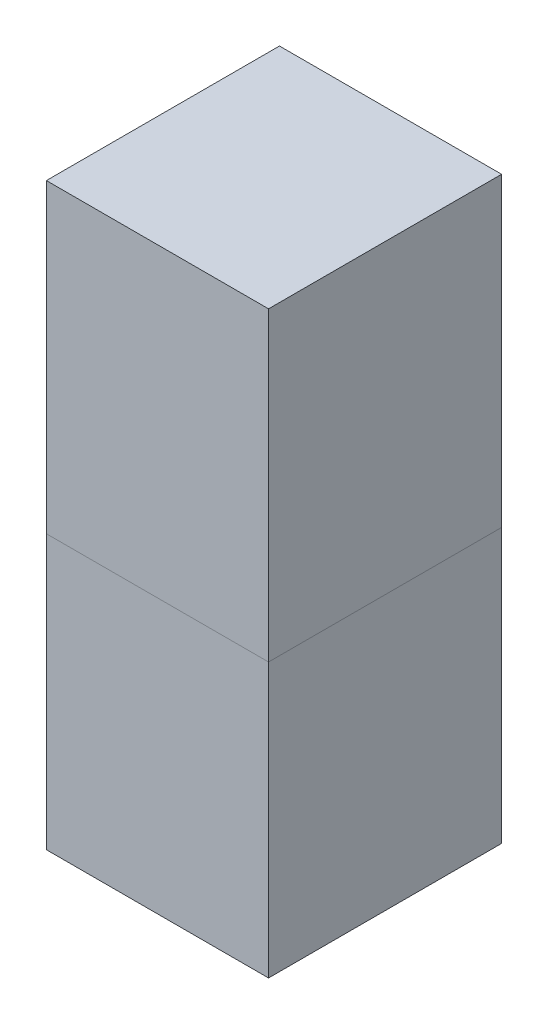
ISO-10303-21;
HEADER;
FILE_DESCRIPTION(('STEP AP214'),'2;1');
FILE_NAME('part.step','',(''),(''),'','','');
FILE_SCHEMA(('AUTOMOTIVE_DESIGN { 1 0 10303 214 1 1 1 1 }'));
ENDSEC;
DATA;
#1=APPLICATION_CONTEXT('core data for automotive mechanical design processes');
#2=APPLICATION_PROTOCOL_DEFINITION('international standard','automotive_design',2000,#1);
#3=PRODUCT_CONTEXT('',#1,'mechanical');
#4=PRODUCT('Part','Part','',(#3));
#5=PRODUCT_RELATED_PRODUCT_CATEGORY('part','',(#4));
#6=PRODUCT_DEFINITION_FORMATION('','',#4);
#7=PRODUCT_DEFINITION_CONTEXT('part definition',#1,'design');
#8=PRODUCT_DEFINITION('design','',#6,#7);
#9=PRODUCT_DEFINITION_SHAPE('','',#8);
#10=(LENGTH_UNIT() NAMED_UNIT(*) SI_UNIT(.MILLI.,.METRE.));
#11=(NAMED_UNIT(*) PLANE_ANGLE_UNIT() SI_UNIT($,.RADIAN.));
#12=(NAMED_UNIT(*) SI_UNIT($,.STERADIAN.) SOLID_ANGLE_UNIT());
#13=UNCERTAINTY_MEASURE_WITH_UNIT(LENGTH_MEASURE(1.E-05),#10,'distance_accuracy_value','');
#14=(GEOMETRIC_REPRESENTATION_CONTEXT(3) GLOBAL_UNCERTAINTY_ASSIGNED_CONTEXT((#13)) GLOBAL_UNIT_ASSIGNED_CONTEXT((#10,
#11,#12)) REPRESENTATION_CONTEXT('',''));
#15=CARTESIAN_POINT('',(0.,0.,0.));
#16=DIRECTION('',(0.,0.,1.));
#17=DIRECTION('',(1.,0.,0.));
#18=AXIS2_PLACEMENT_3D('',#15,#16,#17);
#19=CARTESIAN_POINT('',(0.,-1700.,0.));
#20=DIRECTION('',(0.,1.,0.));
#21=DIRECTION('',(0.,0.,1.));
#22=AXIS2_PLACEMENT_3D('',#19,#20,#21);
#23=PLANE('',#22);
#24=DIRECTION('',(0.,0.,1.));
#25=VECTOR('',#24,1.);
#26=CARTESIAN_POINT('',(345.,-1700.,0.));
#27=LINE('',#26,#25);
#28=CARTESIAN_POINT('',(345.,-1700.,-361.95));
#29=VERTEX_POINT('',#28);
#30=CARTESIAN_POINT('',(345.,-1700.,361.95));
#31=VERTEX_POINT('',#30);
#32=EDGE_CURVE('E193',#29,#31,#27,.T.);
#33=ORIENTED_EDGE('',*,*,#32,.T.);
#34=DIRECTION('',(1.,0.,0.));
#35=VECTOR('',#34,1.);
#36=CARTESIAN_POINT('',(0.,-1700.,361.95));
#37=LINE('',#36,#35);
#38=CARTESIAN_POINT('',(-345.,-1700.,361.95));
#39=VERTEX_POINT('',#38);
#40=EDGE_CURVE('E198',#39,#31,#37,.T.);
#41=ORIENTED_EDGE('',*,*,#40,.F.);
#42=DIRECTION('',(0.,0.,1.));
#43=VECTOR('',#42,1.);
#44=CARTESIAN_POINT('',(-345.,-1700.,0.));
#45=LINE('',#44,#43);
#46=CARTESIAN_POINT('',(-345.,-1700.,-361.95));
#47=VERTEX_POINT('',#46);
#48=EDGE_CURVE('E211',#47,#39,#45,.T.);
#49=ORIENTED_EDGE('',*,*,#48,.F.);
#50=DIRECTION('',(1.,0.,0.));
#51=VECTOR('',#50,1.);
#52=CARTESIAN_POINT('',(0.,-1700.,-361.95));
#53=LINE('',#52,#51);
#54=EDGE_CURVE('E208',#47,#29,#53,.T.);
#55=ORIENTED_EDGE('',*,*,#54,.T.);
#56=EDGE_LOOP('',(#33,#41,#49,#55));
#57=FACE_BOUND('',#56,.T.);
#58=ADVANCED_FACE('F48',(#57),#23,.F.);
#59=CARTESIAN_POINT('',(0.,-850.,361.95));
#60=DIRECTION('',(0.,0.,-1.));
#61=DIRECTION('',(-1.,0.,0.));
#62=AXIS2_PLACEMENT_3D('',#59,#60,#61);
#63=PLANE('',#62);
#64=DIRECTION('',(0.,-1.,0.));
#65=VECTOR('',#64,1.);
#66=CARTESIAN_POINT('',(-345.,-850.,361.95));
#67=LINE('',#66,#65);
#68=CARTESIAN_POINT('',(-345.,-850.,361.95));
#69=VERTEX_POINT('',#68);
#70=EDGE_CURVE('E225',#69,#39,#67,.T.);
#71=ORIENTED_EDGE('',*,*,#70,.T.);
#72=ORIENTED_EDGE('',*,*,#40,.T.);
#73=DIRECTION('',(0.,-1.,0.));
#74=VECTOR('',#73,1.);
#75=CARTESIAN_POINT('',(345.,-850.,361.95));
#76=LINE('',#75,#74);
#77=CARTESIAN_POINT('',(345.,-850.,361.95));
#78=VERTEX_POINT('',#77);
#79=EDGE_CURVE('E205',#78,#31,#76,.T.);
#80=ORIENTED_EDGE('',*,*,#79,.F.);
#81=DIRECTION('',(1.,0.,0.));
#82=VECTOR('',#81,1.);
#83=CARTESIAN_POINT('',(0.,-850.,361.95));
#84=LINE('',#83,#82);
#85=EDGE_CURVE('E203',#69,#78,#84,.T.);
#86=ORIENTED_EDGE('',*,*,#85,.F.);
#87=EDGE_LOOP('',(#71,#72,#80,#86));
#88=FACE_BOUND('',#87,.T.);
#89=ADVANCED_FACE('F247',(#88),#63,.F.);
#90=CARTESIAN_POINT('',(-345.,-850.,0.));
#91=DIRECTION('',(1.,0.,0.));
#92=DIRECTION('',(0.,0.,-1.));
#93=AXIS2_PLACEMENT_3D('',#90,#91,#92);
#94=PLANE('',#93);
#95=DIRECTION('',(0.,-1.,0.));
#96=VECTOR('',#95,1.);
#97=CARTESIAN_POINT('',(-345.,-850.,-361.95));
#98=LINE('',#97,#96);
#99=CARTESIAN_POINT('',(-345.,-850.,-361.95));
#100=VERTEX_POINT('',#99);
#101=EDGE_CURVE('E227',#100,#47,#98,.T.);
#102=ORIENTED_EDGE('',*,*,#101,.T.);
#103=ORIENTED_EDGE('',*,*,#48,.T.);
#104=ORIENTED_EDGE('',*,*,#70,.F.);
#105=DIRECTION('',(0.,0.,1.));
#106=VECTOR('',#105,1.);
#107=CARTESIAN_POINT('',(-345.,-850.,0.));
#108=LINE('',#107,#106);
#109=EDGE_CURVE('E201',#100,#69,#108,.T.);
#110=ORIENTED_EDGE('',*,*,#109,.F.);
#111=EDGE_LOOP('',(#102,#103,#104,#110));
#112=FACE_BOUND('',#111,.T.);
#113=ADVANCED_FACE('F241',(#112),#94,.F.);
#114=CARTESIAN_POINT('',(0.,-850.,-361.95));
#115=DIRECTION('',(0.,0.,-1.));
#116=DIRECTION('',(-1.,0.,0.));
#117=AXIS2_PLACEMENT_3D('',#114,#115,#116);
#118=PLANE('',#117);
#119=DIRECTION('',(0.,-1.,0.));
#120=VECTOR('',#119,1.);
#121=CARTESIAN_POINT('',(345.,-850.,-361.95));
#122=LINE('',#121,#120);
#123=CARTESIAN_POINT('',(345.,-850.,-361.95));
#124=VERTEX_POINT('',#123);
#125=EDGE_CURVE('E219',#124,#29,#122,.T.);
#126=ORIENTED_EDGE('',*,*,#125,.T.);
#127=ORIENTED_EDGE('',*,*,#54,.F.);
#128=ORIENTED_EDGE('',*,*,#101,.F.);
#129=DIRECTION('',(1.,0.,0.));
#130=VECTOR('',#129,1.);
#131=CARTESIAN_POINT('',(0.,-850.,-361.95));
#132=LINE('',#131,#130);
#133=EDGE_CURVE('E197',#100,#124,#132,.T.);
#134=ORIENTED_EDGE('',*,*,#133,.T.);
#135=EDGE_LOOP('',(#126,#127,#128,#134));
#136=FACE_BOUND('',#135,.T.);
#137=ADVANCED_FACE('F231',(#136),#118,.T.);
#138=CARTESIAN_POINT('',(345.,-850.,0.));
#139=DIRECTION('',(1.,0.,0.));
#140=DIRECTION('',(0.,0.,-1.));
#141=AXIS2_PLACEMENT_3D('',#138,#139,#140);
#142=PLANE('',#141);
#143=ORIENTED_EDGE('',*,*,#79,.T.);
#144=ORIENTED_EDGE('',*,*,#32,.F.);
#145=ORIENTED_EDGE('',*,*,#125,.F.);
#146=DIRECTION('',(0.,0.,1.));
#147=VECTOR('',#146,1.);
#148=CARTESIAN_POINT('',(345.,-850.,0.));
#149=LINE('',#148,#147);
#150=EDGE_CURVE('E194',#124,#78,#149,.T.);
#151=ORIENTED_EDGE('',*,*,#150,.T.);
#152=EDGE_LOOP('',(#143,#144,#145,#151));
#153=FACE_BOUND('',#152,.T.);
#154=ADVANCED_FACE('F50',(#153),#142,.T.);
#155=CARTESIAN_POINT('',(0.,-850.,0.));
#156=DIRECTION('',(0.,1.,0.));
#157=DIRECTION('',(0.,0.,1.));
#158=AXIS2_PLACEMENT_3D('',#155,#156,#157);
#159=PLANE('',#158);
#160=ORIENTED_EDGE('',*,*,#150,.F.);
#161=ORIENTED_EDGE('',*,*,#133,.F.);
#162=ORIENTED_EDGE('',*,*,#109,.T.);
#163=ORIENTED_EDGE('',*,*,#85,.T.);
#164=EDGE_LOOP('',(#160,#161,#162,#163));
#165=FACE_BOUND('',#164,.T.);
#166=ADVANCED_FACE('F245',(#165),#159,.T.);
#167=CLOSED_SHELL('',(#58,#89,#113,#137,#154,#166));
#168=CARTESIAN_POINT('',(-343.9,-851.5,-360.85));
#169=DIRECTION('',(-1.,0.,0.));
#170=DIRECTION('',(0.,0.,1.));
#171=AXIS2_PLACEMENT_3D('',#168,#169,#170);
#172=PLANE('',#171);
#173=DIRECTION('',(0.,0.,-1.));
#174=VECTOR('',#173,1.);
#175=CARTESIAN_POINT('',(-343.9,-850.99,-360.85));
#176=LINE('',#175,#174);
#177=CARTESIAN_POINT('',(-343.9,-850.99,360.85));
#178=VERTEX_POINT('',#177);
#179=CARTESIAN_POINT('',(-343.9,-850.99,-360.85));
#180=VERTEX_POINT('',#179);
#181=EDGE_CURVE('E151',#178,#180,#176,.T.);
#182=ORIENTED_EDGE('',*,*,#181,.F.);
#183=DIRECTION('',(0.,1.,0.));
#184=VECTOR('',#183,1.);
#185=CARTESIAN_POINT('',(-343.9,-851.5,360.85));
#186=LINE('',#185,#184);
#187=CARTESIAN_POINT('',(-343.9,-851.5,360.85));
#188=VERTEX_POINT('',#187);
#189=EDGE_CURVE('E138',#188,#178,#186,.T.);
#190=ORIENTED_EDGE('',*,*,#189,.F.);
#191=DIRECTION('',(0.,0.,1.));
#192=VECTOR('',#191,1.);
#193=CARTESIAN_POINT('',(-343.9,-851.5,-360.85));
#194=LINE('',#193,#192);
#195=CARTESIAN_POINT('',(-343.9,-851.5,-360.85));
#196=VERTEX_POINT('',#195);
#197=EDGE_CURVE('E155',#196,#188,#194,.T.);
#198=ORIENTED_EDGE('',*,*,#197,.F.);
#199=DIRECTION('',(0.,1.,0.));
#200=VECTOR('',#199,1.);
#201=CARTESIAN_POINT('',(-343.9,-851.5,-360.85));
#202=LINE('',#201,#200);
#203=EDGE_CURVE('E153',#196,#180,#202,.T.);
#204=ORIENTED_EDGE('',*,*,#203,.T.);
#205=EDGE_LOOP('',(#182,#190,#198,#204));
#206=FACE_BOUND('',#205,.T.);
#207=ADVANCED_FACE('F152',(#206),#172,.F.);
#208=CARTESIAN_POINT('',(343.9,-851.5,-360.85));
#209=DIRECTION('',(0.,0.,-1.));
#210=DIRECTION('',(-1.,0.,0.));
#211=AXIS2_PLACEMENT_3D('',#208,#209,#210);
#212=PLANE('',#211);
#213=DIRECTION('',(1.,0.,0.));
#214=VECTOR('',#213,1.);
#215=CARTESIAN_POINT('',(343.9,-850.99,-360.85));
#216=LINE('',#215,#214);
#217=CARTESIAN_POINT('',(343.9,-850.99,-360.85));
#218=VERTEX_POINT('',#217);
#219=EDGE_CURVE('E64',#180,#218,#216,.T.);
#220=ORIENTED_EDGE('',*,*,#219,.F.);
#221=ORIENTED_EDGE('',*,*,#203,.F.);
#222=DIRECTION('',(-1.,0.,0.));
#223=VECTOR('',#222,1.);
#224=CARTESIAN_POINT('',(343.9,-851.5,-360.85));
#225=LINE('',#224,#223);
#226=CARTESIAN_POINT('',(343.9,-851.5,-360.85));
#227=VERTEX_POINT('',#226);
#228=EDGE_CURVE('E148',#227,#196,#225,.T.);
#229=ORIENTED_EDGE('',*,*,#228,.F.);
#230=DIRECTION('',(0.,1.,0.));
#231=VECTOR('',#230,1.);
#232=CARTESIAN_POINT('',(343.9,-851.5,-360.85));
#233=LINE('',#232,#231);
#234=EDGE_CURVE('E170',#227,#218,#233,.T.);
#235=ORIENTED_EDGE('',*,*,#234,.T.);
#236=EDGE_LOOP('',(#220,#221,#229,#235));
#237=FACE_BOUND('',#236,.T.);
#238=ADVANCED_FACE('F290',(#237),#212,.F.);
#239=CARTESIAN_POINT('',(343.9,-851.5,360.85));
#240=DIRECTION('',(1.,0.,0.));
#241=DIRECTION('',(0.,0.,-1.));
#242=AXIS2_PLACEMENT_3D('',#239,#240,#241);
#243=PLANE('',#242);
#244=DIRECTION('',(0.,0.,1.));
#245=VECTOR('',#244,1.);
#246=CARTESIAN_POINT('',(343.9,-850.99,360.85));
#247=LINE('',#246,#245);
#248=CARTESIAN_POINT('',(343.9,-850.99,360.85));
#249=VERTEX_POINT('',#248);
#250=EDGE_CURVE('E72',#218,#249,#247,.T.);
#251=ORIENTED_EDGE('',*,*,#250,.F.);
#252=ORIENTED_EDGE('',*,*,#234,.F.);
#253=DIRECTION('',(0.,0.,-1.));
#254=VECTOR('',#253,1.);
#255=CARTESIAN_POINT('',(343.9,-851.5,360.85));
#256=LINE('',#255,#254);
#257=CARTESIAN_POINT('',(343.9,-851.5,360.85));
#258=VERTEX_POINT('',#257);
#259=EDGE_CURVE('E163',#258,#227,#256,.T.);
#260=ORIENTED_EDGE('',*,*,#259,.F.);
#261=DIRECTION('',(0.,1.,0.));
#262=VECTOR('',#261,1.);
#263=CARTESIAN_POINT('',(343.9,-851.5,360.85));
#264=LINE('',#263,#262);
#265=EDGE_CURVE('E147',#258,#249,#264,.T.);
#266=ORIENTED_EDGE('',*,*,#265,.T.);
#267=EDGE_LOOP('',(#251,#252,#260,#266));
#268=FACE_BOUND('',#267,.T.);
#269=ADVANCED_FACE('F295',(#268),#243,.F.);
#270=CARTESIAN_POINT('',(-343.9,-851.5,360.85));
#271=DIRECTION('',(0.,0.,1.));
#272=DIRECTION('',(1.,0.,0.));
#273=AXIS2_PLACEMENT_3D('',#270,#271,#272);
#274=PLANE('',#273);
#275=DIRECTION('',(-1.,0.,0.));
#276=VECTOR('',#275,1.);
#277=CARTESIAN_POINT('',(-343.9,-850.99,360.85));
#278=LINE('',#277,#276);
#279=EDGE_CURVE('E12',#249,#178,#278,.T.);
#280=ORIENTED_EDGE('',*,*,#279,.F.);
#281=ORIENTED_EDGE('',*,*,#265,.F.);
#282=DIRECTION('',(1.,0.,0.));
#283=VECTOR('',#282,1.);
#284=CARTESIAN_POINT('',(-343.9,-851.5,360.85));
#285=LINE('',#284,#283);
#286=EDGE_CURVE('E143',#188,#258,#285,.T.);
#287=ORIENTED_EDGE('',*,*,#286,.F.);
#288=ORIENTED_EDGE('',*,*,#189,.T.);
#289=EDGE_LOOP('',(#280,#281,#287,#288));
#290=FACE_BOUND('',#289,.T.);
#291=ADVANCED_FACE('F140',(#290),#274,.F.);
#292=CARTESIAN_POINT('',(0.,-851.5,0.));
#293=DIRECTION('',(0.,-1.,0.));
#294=DIRECTION('',(0.,0.,-1.));
#295=AXIS2_PLACEMENT_3D('',#292,#293,#294);
#296=PLANE('',#295);
#297=ORIENTED_EDGE('',*,*,#197,.T.);
#298=ORIENTED_EDGE('',*,*,#286,.T.);
#299=ORIENTED_EDGE('',*,*,#259,.T.);
#300=ORIENTED_EDGE('',*,*,#228,.T.);
#301=EDGE_LOOP('',(#297,#298,#299,#300));
#302=FACE_BOUND('',#301,.T.);
#303=DIRECTION('',(0.,0.,1.));
#304=VECTOR('',#303,1.);
#305=CARTESIAN_POINT('',(-344.,-851.5,360.95));
#306=LINE('',#305,#304);
#307=CARTESIAN_POINT('',(-344.,-851.5,-360.95));
#308=VERTEX_POINT('',#307);
#309=CARTESIAN_POINT('',(-344.,-851.5,360.95));
#310=VERTEX_POINT('',#309);
#311=EDGE_CURVE('E169',#308,#310,#306,.T.);
#312=ORIENTED_EDGE('',*,*,#311,.F.);
#313=DIRECTION('',(-1.,0.,0.));
#314=VECTOR('',#313,1.);
#315=CARTESIAN_POINT('',(-344.,-851.5,-360.95));
#316=LINE('',#315,#314);
#317=CARTESIAN_POINT('',(344.,-851.5,-360.95));
#318=VERTEX_POINT('',#317);
#319=EDGE_CURVE('E178',#318,#308,#316,.T.);
#320=ORIENTED_EDGE('',*,*,#319,.F.);
#321=DIRECTION('',(0.,0.,-1.));
#322=VECTOR('',#321,1.);
#323=CARTESIAN_POINT('',(344.,-851.5,360.95));
#324=LINE('',#323,#322);
#325=CARTESIAN_POINT('',(344.,-851.5,360.95));
#326=VERTEX_POINT('',#325);
#327=EDGE_CURVE('E176',#326,#318,#324,.T.);
#328=ORIENTED_EDGE('',*,*,#327,.F.);
#329=DIRECTION('',(1.,0.,0.));
#330=VECTOR('',#329,1.);
#331=CARTESIAN_POINT('',(-344.,-851.5,360.95));
#332=LINE('',#331,#330);
#333=EDGE_CURVE('E174',#310,#326,#332,.T.);
#334=ORIENTED_EDGE('',*,*,#333,.F.);
#335=EDGE_LOOP('',(#312,#320,#328,#334));
#336=FACE_BOUND('',#335,.T.);
#337=ADVANCED_FACE('F299',(#302,#336),#296,.T.);
#338=CARTESIAN_POINT('',(0.,-1699.,0.));
#339=DIRECTION('',(0.,-1.,0.));
#340=DIRECTION('',(0.,0.,-1.));
#341=AXIS2_PLACEMENT_3D('',#338,#339,#340);
#342=PLANE('',#341);
#343=DIRECTION('',(0.,0.,1.));
#344=VECTOR('',#343,1.);
#345=CARTESIAN_POINT('',(-344.,-1699.,360.95));
#346=LINE('',#345,#344);
#347=CARTESIAN_POINT('',(-344.,-1699.,-360.95));
#348=VERTEX_POINT('',#347);
#349=CARTESIAN_POINT('',(-344.,-1699.,360.95));
#350=VERTEX_POINT('',#349);
#351=EDGE_CURVE('E181',#348,#350,#346,.T.);
#352=ORIENTED_EDGE('',*,*,#351,.T.);
#353=DIRECTION('',(1.,0.,0.));
#354=VECTOR('',#353,1.);
#355=CARTESIAN_POINT('',(-344.,-1699.,360.95));
#356=LINE('',#355,#354);
#357=CARTESIAN_POINT('',(344.,-1699.,360.95));
#358=VERTEX_POINT('',#357);
#359=EDGE_CURVE('E184',#350,#358,#356,.T.);
#360=ORIENTED_EDGE('',*,*,#359,.T.);
#361=DIRECTION('',(0.,0.,-1.));
#362=VECTOR('',#361,1.);
#363=CARTESIAN_POINT('',(344.,-1699.,360.95));
#364=LINE('',#363,#362);
#365=CARTESIAN_POINT('',(344.,-1699.,-360.95));
#366=VERTEX_POINT('',#365);
#367=EDGE_CURVE('E187',#358,#366,#364,.T.);
#368=ORIENTED_EDGE('',*,*,#367,.T.);
#369=DIRECTION('',(-1.,0.,0.));
#370=VECTOR('',#369,1.);
#371=CARTESIAN_POINT('',(-344.,-1699.,-360.95));
#372=LINE('',#371,#370);
#373=EDGE_CURVE('E190',#366,#348,#372,.T.);
#374=ORIENTED_EDGE('',*,*,#373,.T.);
#375=EDGE_LOOP('',(#352,#360,#368,#374));
#376=FACE_BOUND('',#375,.T.);
#377=ADVANCED_FACE('F271',(#376),#342,.F.);
#378=CARTESIAN_POINT('',(-344.,-850.,0.));
#379=DIRECTION('',(1.,0.,0.));
#380=DIRECTION('',(0.,0.,-1.));
#381=AXIS2_PLACEMENT_3D('',#378,#379,#380);
#382=PLANE('',#381);
#383=ORIENTED_EDGE('',*,*,#311,.T.);
#384=DIRECTION('',(0.,-1.,0.));
#385=VECTOR('',#384,1.);
#386=CARTESIAN_POINT('',(-344.,-850.,360.95));
#387=LINE('',#386,#385);
#388=EDGE_CURVE('E218',#310,#350,#387,.T.);
#389=ORIENTED_EDGE('',*,*,#388,.T.);
#390=ORIENTED_EDGE('',*,*,#351,.F.);
#391=DIRECTION('',(0.,-1.,0.));
#392=VECTOR('',#391,1.);
#393=CARTESIAN_POINT('',(-344.,-850.,-360.95));
#394=LINE('',#393,#392);
#395=EDGE_CURVE('E216',#308,#348,#394,.T.);
#396=ORIENTED_EDGE('',*,*,#395,.F.);
#397=EDGE_LOOP('',(#383,#389,#390,#396));
#398=FACE_BOUND('',#397,.T.);
#399=ADVANCED_FACE('F274',(#398),#382,.T.);
#400=CARTESIAN_POINT('',(0.,-850.,360.95));
#401=DIRECTION('',(0.,0.,-1.));
#402=DIRECTION('',(-1.,0.,0.));
#403=AXIS2_PLACEMENT_3D('',#400,#401,#402);
#404=PLANE('',#403);
#405=ORIENTED_EDGE('',*,*,#333,.T.);
#406=DIRECTION('',(0.,-1.,0.));
#407=VECTOR('',#406,1.);
#408=CARTESIAN_POINT('',(344.,-850.,360.95));
#409=LINE('',#408,#407);
#410=EDGE_CURVE('E221',#326,#358,#409,.T.);
#411=ORIENTED_EDGE('',*,*,#410,.T.);
#412=ORIENTED_EDGE('',*,*,#359,.F.);
#413=ORIENTED_EDGE('',*,*,#388,.F.);
#414=EDGE_LOOP('',(#405,#411,#412,#413));
#415=FACE_BOUND('',#414,.T.);
#416=ADVANCED_FACE('F277',(#415),#404,.T.);
#417=CARTESIAN_POINT('',(344.,-850.,0.));
#418=DIRECTION('',(1.,0.,0.));
#419=DIRECTION('',(0.,0.,-1.));
#420=AXIS2_PLACEMENT_3D('',#417,#418,#419);
#421=PLANE('',#420);
#422=ORIENTED_EDGE('',*,*,#410,.F.);
#423=ORIENTED_EDGE('',*,*,#327,.T.);
#424=DIRECTION('',(0.,-1.,0.));
#425=VECTOR('',#424,1.);
#426=CARTESIAN_POINT('',(344.,-850.,-360.95));
#427=LINE('',#426,#425);
#428=EDGE_CURVE('E57',#318,#366,#427,.T.);
#429=ORIENTED_EDGE('',*,*,#428,.T.);
#430=ORIENTED_EDGE('',*,*,#367,.F.);
#431=EDGE_LOOP('',(#422,#423,#429,#430));
#432=FACE_BOUND('',#431,.T.);
#433=ADVANCED_FACE('F281',(#432),#421,.F.);
#434=CARTESIAN_POINT('',(0.,-850.,-360.95));
#435=DIRECTION('',(0.,0.,-1.));
#436=DIRECTION('',(-1.,0.,0.));
#437=AXIS2_PLACEMENT_3D('',#434,#435,#436);
#438=PLANE('',#437);
#439=ORIENTED_EDGE('',*,*,#428,.F.);
#440=ORIENTED_EDGE('',*,*,#319,.T.);
#441=ORIENTED_EDGE('',*,*,#395,.T.);
#442=ORIENTED_EDGE('',*,*,#373,.F.);
#443=EDGE_LOOP('',(#439,#440,#441,#442));
#444=FACE_BOUND('',#443,.T.);
#445=ADVANCED_FACE('F257',(#444),#438,.F.);
#446=CARTESIAN_POINT('',(0.,-850.99,0.));
#447=DIRECTION('',(0.,1.,0.));
#448=DIRECTION('',(0.,0.,1.));
#449=AXIS2_PLACEMENT_3D('',#446,#447,#448);
#450=PLANE('',#449);
#451=ORIENTED_EDGE('',*,*,#279,.T.);
#452=ORIENTED_EDGE('',*,*,#181,.T.);
#453=ORIENTED_EDGE('',*,*,#219,.T.);
#454=ORIENTED_EDGE('',*,*,#250,.T.);
#455=EDGE_LOOP('',(#451,#452,#453,#454));
#456=FACE_BOUND('',#455,.T.);
#457=ADVANCED_FACE('F157',(#456),#450,.F.);
#458=CLOSED_SHELL('',(#207,#238,#269,#291,#337,#377,#399,#416,#433,#445,#457));
#459=ORIENTED_CLOSED_SHELL('',*,#458,.T.);
#460=BREP_WITH_VOIDS('B2',#167,(#459));
#461=CARTESIAN_POINT('',(0.,-850.,0.));
#462=DIRECTION('',(0.,1.,0.));
#463=DIRECTION('',(0.,0.,1.));
#464=AXIS2_PLACEMENT_3D('',#461,#462,#463);
#465=PLANE('',#464);
#466=DIRECTION('',(0.,0.,1.));
#467=VECTOR('',#466,1.);
#468=CARTESIAN_POINT('',(345.,-850.,0.));
#469=LINE('',#468,#467);
#470=CARTESIAN_POINT('',(345.,-850.,-361.95));
#471=VERTEX_POINT('',#470);
#472=CARTESIAN_POINT('',(345.,-850.,361.95));
#473=VERTEX_POINT('',#472);
#474=EDGE_CURVE('E601',#471,#473,#469,.T.);
#475=ORIENTED_EDGE('',*,*,#474,.T.);
#476=DIRECTION('',(1.,0.,0.));
#477=VECTOR('',#476,1.);
#478=CARTESIAN_POINT('',(0.,-850.,361.95));
#479=LINE('',#478,#477);
#480=CARTESIAN_POINT('',(-345.,-850.,361.95));
#481=VERTEX_POINT('',#480);
#482=EDGE_CURVE('E608',#481,#473,#479,.T.);
#483=ORIENTED_EDGE('',*,*,#482,.F.);
#484=DIRECTION('',(0.,0.,1.));
#485=VECTOR('',#484,1.);
#486=CARTESIAN_POINT('',(-345.,-850.,0.));
#487=LINE('',#486,#485);
#488=CARTESIAN_POINT('',(-345.,-850.,-361.95));
#489=VERTEX_POINT('',#488);
#490=EDGE_CURVE('E532',#489,#481,#487,.T.);
#491=ORIENTED_EDGE('',*,*,#490,.F.);
#492=DIRECTION('',(1.,0.,0.));
#493=VECTOR('',#492,1.);
#494=CARTESIAN_POINT('',(0.,-850.,-361.95));
#495=LINE('',#494,#493);
#496=EDGE_CURVE('E604',#489,#471,#495,.T.);
#497=ORIENTED_EDGE('',*,*,#496,.T.);
#498=EDGE_LOOP('',(#475,#483,#491,#497));
#499=FACE_BOUND('',#498,.T.);
#500=ADVANCED_FACE('F435',(#499),#465,.F.);
#501=CARTESIAN_POINT('',(0.,0.,361.95));
#502=DIRECTION('',(0.,0.,-1.));
#503=DIRECTION('',(-1.,0.,0.));
#504=AXIS2_PLACEMENT_3D('',#501,#502,#503);
#505=PLANE('',#504);
#506=DIRECTION('',(0.,-1.,0.));
#507=VECTOR('',#506,1.);
#508=CARTESIAN_POINT('',(-345.,0.,361.95));
#509=LINE('',#508,#507);
#510=CARTESIAN_POINT('',(-345.,100.,361.95));
#511=VERTEX_POINT('',#510);
#512=EDGE_CURVE('E526',#511,#481,#509,.T.);
#513=ORIENTED_EDGE('',*,*,#512,.T.);
#514=ORIENTED_EDGE('',*,*,#482,.T.);
#515=DIRECTION('',(0.,-1.,0.));
#516=VECTOR('',#515,1.);
#517=CARTESIAN_POINT('',(345.,0.,361.95));
#518=LINE('',#517,#516);
#519=CARTESIAN_POINT('',(345.,100.,361.95));
#520=VERTEX_POINT('',#519);
#521=EDGE_CURVE('E537',#520,#473,#518,.T.);
#522=ORIENTED_EDGE('',*,*,#521,.F.);
#523=DIRECTION('',(1.,0.,0.));
#524=VECTOR('',#523,1.);
#525=CARTESIAN_POINT('',(-345.,100.,361.95));
#526=LINE('',#525,#524);
#527=EDGE_CURVE('E540',#511,#520,#526,.T.);
#528=ORIENTED_EDGE('',*,*,#527,.F.);
#529=EDGE_LOOP('',(#513,#514,#522,#528));
#530=FACE_BOUND('',#529,.T.);
#531=ADVANCED_FACE('F541',(#530),#505,.F.);
#532=CARTESIAN_POINT('',(-345.,0.,0.));
#533=DIRECTION('',(1.,0.,0.));
#534=DIRECTION('',(0.,0.,-1.));
#535=AXIS2_PLACEMENT_3D('',#532,#533,#534);
#536=PLANE('',#535);
#537=DIRECTION('',(0.,-1.,0.));
#538=VECTOR('',#537,1.);
#539=CARTESIAN_POINT('',(-345.,0.,-361.95));
#540=LINE('',#539,#538);
#541=CARTESIAN_POINT('',(-345.,100.,-361.95));
#542=VERTEX_POINT('',#541);
#543=EDGE_CURVE('E536',#542,#489,#540,.T.);
#544=ORIENTED_EDGE('',*,*,#543,.T.);
#545=ORIENTED_EDGE('',*,*,#490,.T.);
#546=ORIENTED_EDGE('',*,*,#512,.F.);
#547=DIRECTION('',(0.,0.,1.));
#548=VECTOR('',#547,1.);
#549=CARTESIAN_POINT('',(-345.,100.,-361.95));
#550=LINE('',#549,#548);
#551=EDGE_CURVE('E530',#542,#511,#550,.T.);
#552=ORIENTED_EDGE('',*,*,#551,.F.);
#553=EDGE_LOOP('',(#544,#545,#546,#552));
#554=FACE_BOUND('',#553,.T.);
#555=ADVANCED_FACE('F528',(#554),#536,.F.);
#556=CARTESIAN_POINT('',(0.,0.,-361.95));
#557=DIRECTION('',(0.,0.,-1.));
#558=DIRECTION('',(-1.,0.,0.));
#559=AXIS2_PLACEMENT_3D('',#556,#557,#558);
#560=PLANE('',#559);
#561=DIRECTION('',(0.,-1.,0.));
#562=VECTOR('',#561,1.);
#563=CARTESIAN_POINT('',(345.,0.,-361.95));
#564=LINE('',#563,#562);
#565=CARTESIAN_POINT('',(345.,100.,-361.95));
#566=VERTEX_POINT('',#565);
#567=EDGE_CURVE('E613',#566,#471,#564,.T.);
#568=ORIENTED_EDGE('',*,*,#567,.T.);
#569=ORIENTED_EDGE('',*,*,#496,.F.);
#570=ORIENTED_EDGE('',*,*,#543,.F.);
#571=DIRECTION('',(-1.,0.,0.));
#572=VECTOR('',#571,1.);
#573=CARTESIAN_POINT('',(-345.,100.,-361.95));
#574=LINE('',#573,#572);
#575=EDGE_CURVE('E550',#566,#542,#574,.T.);
#576=ORIENTED_EDGE('',*,*,#575,.F.);
#577=EDGE_LOOP('',(#568,#569,#570,#576));
#578=FACE_BOUND('',#577,.T.);
#579=ADVANCED_FACE('F622',(#578),#560,.T.);
#580=CARTESIAN_POINT('',(345.,0.,0.));
#581=DIRECTION('',(1.,0.,0.));
#582=DIRECTION('',(0.,0.,-1.));
#583=AXIS2_PLACEMENT_3D('',#580,#581,#582);
#584=PLANE('',#583);
#585=ORIENTED_EDGE('',*,*,#521,.T.);
#586=ORIENTED_EDGE('',*,*,#474,.F.);
#587=ORIENTED_EDGE('',*,*,#567,.F.);
#588=DIRECTION('',(0.,0.,-1.));
#589=VECTOR('',#588,1.);
#590=CARTESIAN_POINT('',(345.,100.,-361.95));
#591=LINE('',#590,#589);
#592=EDGE_CURVE('E545',#520,#566,#591,.T.);
#593=ORIENTED_EDGE('',*,*,#592,.F.);
#594=EDGE_LOOP('',(#585,#586,#587,#593));
#595=FACE_BOUND('',#594,.T.);
#596=ADVANCED_FACE('F437',(#595),#584,.T.);
#597=CARTESIAN_POINT('',(0.,100.,0.));
#598=DIRECTION('',(0.,1.,0.));
#599=DIRECTION('',(0.,0.,1.));
#600=AXIS2_PLACEMENT_3D('',#597,#598,#599);
#601=PLANE('',#600);
#602=ORIENTED_EDGE('',*,*,#551,.T.);
#603=ORIENTED_EDGE('',*,*,#527,.T.);
#604=ORIENTED_EDGE('',*,*,#592,.T.);
#605=ORIENTED_EDGE('',*,*,#575,.T.);
#606=EDGE_LOOP('',(#602,#603,#604,#605));
#607=FACE_BOUND('',#606,.T.);
#608=ADVANCED_FACE('F548',(#607),#601,.T.);
#609=CLOSED_SHELL('',(#500,#531,#555,#579,#596,#608));
#610=CARTESIAN_POINT('',(-343.9,-1.5,-360.85));
#611=DIRECTION('',(-1.,0.,0.));
#612=DIRECTION('',(0.,0.,1.));
#613=AXIS2_PLACEMENT_3D('',#610,#611,#612);
#614=PLANE('',#613);
#615=DIRECTION('',(0.,0.,-1.));
#616=VECTOR('',#615,1.);
#617=CARTESIAN_POINT('',(-343.9,-0.99,-360.85));
#618=LINE('',#617,#616);
#619=CARTESIAN_POINT('',(-343.9,-0.99,360.85));
#620=VERTEX_POINT('',#619);
#621=CARTESIAN_POINT('',(-343.9,-0.99,-360.85));
#622=VERTEX_POINT('',#621);
#623=EDGE_CURVE('E557',#620,#622,#618,.T.);
#624=ORIENTED_EDGE('',*,*,#623,.F.);
#625=DIRECTION('',(0.,1.,0.));
#626=VECTOR('',#625,1.);
#627=CARTESIAN_POINT('',(-343.9,-1.5,360.85));
#628=LINE('',#627,#626);
#629=CARTESIAN_POINT('',(-343.9,-1.5,360.85));
#630=VERTEX_POINT('',#629);
#631=EDGE_CURVE('E572',#630,#620,#628,.T.);
#632=ORIENTED_EDGE('',*,*,#631,.F.);
#633=DIRECTION('',(0.,0.,1.));
#634=VECTOR('',#633,1.);
#635=CARTESIAN_POINT('',(-343.9,-1.5,-360.85));
#636=LINE('',#635,#634);
#637=CARTESIAN_POINT('',(-343.9,-1.5,-360.85));
#638=VERTEX_POINT('',#637);
#639=EDGE_CURVE('E560',#638,#630,#636,.T.);
#640=ORIENTED_EDGE('',*,*,#639,.F.);
#641=DIRECTION('',(0.,1.,0.));
#642=VECTOR('',#641,1.);
#643=CARTESIAN_POINT('',(-343.9,-1.5,-360.85));
#644=LINE('',#643,#642);
#645=EDGE_CURVE('E573',#638,#622,#644,.T.);
#646=ORIENTED_EDGE('',*,*,#645,.T.);
#647=EDGE_LOOP('',(#624,#632,#640,#646));
#648=FACE_BOUND('',#647,.T.);
#649=ADVANCED_FACE('F673',(#648),#614,.F.);
#650=CARTESIAN_POINT('',(343.9,-1.5,-360.85));
#651=DIRECTION('',(0.,0.,-1.));
#652=DIRECTION('',(-1.,0.,0.));
#653=AXIS2_PLACEMENT_3D('',#650,#651,#652);
#654=PLANE('',#653);
#655=DIRECTION('',(1.,0.,0.));
#656=VECTOR('',#655,1.);
#657=CARTESIAN_POINT('',(343.9,-0.99,-360.85));
#658=LINE('',#657,#656);
#659=CARTESIAN_POINT('',(343.9,-0.99,-360.85));
#660=VERTEX_POINT('',#659);
#661=EDGE_CURVE('E451',#622,#660,#658,.T.);
#662=ORIENTED_EDGE('',*,*,#661,.F.);
#663=ORIENTED_EDGE('',*,*,#645,.F.);
#664=DIRECTION('',(-1.,0.,0.));
#665=VECTOR('',#664,1.);
#666=CARTESIAN_POINT('',(343.9,-1.5,-360.85));
#667=LINE('',#666,#665);
#668=CARTESIAN_POINT('',(343.9,-1.5,-360.85));
#669=VERTEX_POINT('',#668);
#670=EDGE_CURVE('E569',#669,#638,#667,.T.);
#671=ORIENTED_EDGE('',*,*,#670,.F.);
#672=DIRECTION('',(0.,1.,0.));
#673=VECTOR('',#672,1.);
#674=CARTESIAN_POINT('',(343.9,-1.5,-360.85));
#675=LINE('',#674,#673);
#676=EDGE_CURVE('E576',#669,#660,#675,.T.);
#677=ORIENTED_EDGE('',*,*,#676,.T.);
#678=EDGE_LOOP('',(#662,#663,#671,#677));
#679=FACE_BOUND('',#678,.T.);
#680=ADVANCED_FACE('F669',(#679),#654,.F.);
#681=CARTESIAN_POINT('',(343.9,-1.5,360.85));
#682=DIRECTION('',(1.,0.,0.));
#683=DIRECTION('',(0.,0.,-1.));
#684=AXIS2_PLACEMENT_3D('',#681,#682,#683);
#685=PLANE('',#684);
#686=DIRECTION('',(0.,0.,1.));
#687=VECTOR('',#686,1.);
#688=CARTESIAN_POINT('',(343.9,-0.99,360.85));
#689=LINE('',#688,#687);
#690=CARTESIAN_POINT('',(343.9,-0.99,360.85));
#691=VERTEX_POINT('',#690);
#692=EDGE_CURVE('E459',#660,#691,#689,.T.);
#693=ORIENTED_EDGE('',*,*,#692,.F.);
#694=ORIENTED_EDGE('',*,*,#676,.F.);
#695=DIRECTION('',(0.,0.,-1.));
#696=VECTOR('',#695,1.);
#697=CARTESIAN_POINT('',(343.9,-1.5,360.85));
#698=LINE('',#697,#696);
#699=CARTESIAN_POINT('',(343.9,-1.5,360.85));
#700=VERTEX_POINT('',#699);
#701=EDGE_CURVE('E566',#700,#669,#698,.T.);
#702=ORIENTED_EDGE('',*,*,#701,.F.);
#703=DIRECTION('',(0.,1.,0.));
#704=VECTOR('',#703,1.);
#705=CARTESIAN_POINT('',(343.9,-1.5,360.85));
#706=LINE('',#705,#704);
#707=EDGE_CURVE('E578',#700,#691,#706,.T.);
#708=ORIENTED_EDGE('',*,*,#707,.T.);
#709=EDGE_LOOP('',(#693,#694,#702,#708));
#710=FACE_BOUND('',#709,.T.);
#711=ADVANCED_FACE('F672',(#710),#685,.F.);
#712=CARTESIAN_POINT('',(-343.9,-1.5,360.85));
#713=DIRECTION('',(0.,0.,1.));
#714=DIRECTION('',(1.,0.,0.));
#715=AXIS2_PLACEMENT_3D('',#712,#713,#714);
#716=PLANE('',#715);
#717=DIRECTION('',(-1.,0.,0.));
#718=VECTOR('',#717,1.);
#719=CARTESIAN_POINT('',(-343.9,-0.99,360.85));
#720=LINE('',#719,#718);
#721=EDGE_CURVE('E45',#691,#620,#720,.T.);
#722=ORIENTED_EDGE('',*,*,#721,.F.);
#723=ORIENTED_EDGE('',*,*,#707,.F.);
#724=DIRECTION('',(1.,0.,0.));
#725=VECTOR('',#724,1.);
#726=CARTESIAN_POINT('',(-343.9,-1.5,360.85));
#727=LINE('',#726,#725);
#728=EDGE_CURVE('E563',#630,#700,#727,.T.);
#729=ORIENTED_EDGE('',*,*,#728,.F.);
#730=ORIENTED_EDGE('',*,*,#631,.T.);
#731=EDGE_LOOP('',(#722,#723,#729,#730));
#732=FACE_BOUND('',#731,.T.);
#733=ADVANCED_FACE('F676',(#732),#716,.F.);
#734=CARTESIAN_POINT('',(0.,-1.5,0.));
#735=DIRECTION('',(0.,-1.,0.));
#736=DIRECTION('',(0.,0.,-1.));
#737=AXIS2_PLACEMENT_3D('',#734,#735,#736);
#738=PLANE('',#737);
#739=ORIENTED_EDGE('',*,*,#639,.T.);
#740=ORIENTED_EDGE('',*,*,#728,.T.);
#741=ORIENTED_EDGE('',*,*,#701,.T.);
#742=ORIENTED_EDGE('',*,*,#670,.T.);
#743=EDGE_LOOP('',(#739,#740,#741,#742));
#744=FACE_BOUND('',#743,.T.);
#745=DIRECTION('',(0.,0.,1.));
#746=VECTOR('',#745,1.);
#747=CARTESIAN_POINT('',(-344.,-1.5,360.95));
#748=LINE('',#747,#746);
#749=CARTESIAN_POINT('',(-344.,-1.5,-360.95));
#750=VERTEX_POINT('',#749);
#751=CARTESIAN_POINT('',(-344.,-1.5,360.95));
#752=VERTEX_POINT('',#751);
#753=EDGE_CURVE('E575',#750,#752,#748,.T.);
#754=ORIENTED_EDGE('',*,*,#753,.F.);
#755=DIRECTION('',(-1.,0.,0.));
#756=VECTOR('',#755,1.);
#757=CARTESIAN_POINT('',(-344.,-1.5,-360.95));
#758=LINE('',#757,#756);
#759=CARTESIAN_POINT('',(344.,-1.5,-360.95));
#760=VERTEX_POINT('',#759);
#761=EDGE_CURVE('E586',#760,#750,#758,.T.);
#762=ORIENTED_EDGE('',*,*,#761,.F.);
#763=DIRECTION('',(0.,0.,-1.));
#764=VECTOR('',#763,1.);
#765=CARTESIAN_POINT('',(344.,-1.5,360.95));
#766=LINE('',#765,#764);
#767=CARTESIAN_POINT('',(344.,-1.5,360.95));
#768=VERTEX_POINT('',#767);
#769=EDGE_CURVE('E584',#768,#760,#766,.T.);
#770=ORIENTED_EDGE('',*,*,#769,.F.);
#771=DIRECTION('',(1.,0.,0.));
#772=VECTOR('',#771,1.);
#773=CARTESIAN_POINT('',(-344.,-1.5,360.95));
#774=LINE('',#773,#772);
#775=EDGE_CURVE('E582',#752,#768,#774,.T.);
#776=ORIENTED_EDGE('',*,*,#775,.F.);
#777=EDGE_LOOP('',(#754,#762,#770,#776));
#778=FACE_BOUND('',#777,.T.);
#779=ADVANCED_FACE('F679',(#744,#778),#738,.T.);
#780=CARTESIAN_POINT('',(0.,-849.,0.));
#781=DIRECTION('',(0.,-1.,0.));
#782=DIRECTION('',(0.,0.,-1.));
#783=AXIS2_PLACEMENT_3D('',#780,#781,#782);
#784=PLANE('',#783);
#785=DIRECTION('',(0.,0.,1.));
#786=VECTOR('',#785,1.);
#787=CARTESIAN_POINT('',(-344.,-849.,360.95));
#788=LINE('',#787,#786);
#789=CARTESIAN_POINT('',(-344.,-849.,-360.95));
#790=VERTEX_POINT('',#789);
#791=CARTESIAN_POINT('',(-344.,-849.,360.95));
#792=VERTEX_POINT('',#791);
#793=EDGE_CURVE('E589',#790,#792,#788,.T.);
#794=ORIENTED_EDGE('',*,*,#793,.T.);
#795=DIRECTION('',(1.,0.,0.));
#796=VECTOR('',#795,1.);
#797=CARTESIAN_POINT('',(-344.,-849.,360.95));
#798=LINE('',#797,#796);
#799=CARTESIAN_POINT('',(344.,-849.,360.95));
#800=VERTEX_POINT('',#799);
#801=EDGE_CURVE('E592',#792,#800,#798,.T.);
#802=ORIENTED_EDGE('',*,*,#801,.T.);
#803=DIRECTION('',(0.,0.,-1.));
#804=VECTOR('',#803,1.);
#805=CARTESIAN_POINT('',(344.,-849.,360.95));
#806=LINE('',#805,#804);
#807=CARTESIAN_POINT('',(344.,-849.,-360.95));
#808=VERTEX_POINT('',#807);
#809=EDGE_CURVE('E595',#800,#808,#806,.T.);
#810=ORIENTED_EDGE('',*,*,#809,.T.);
#811=DIRECTION('',(-1.,0.,0.));
#812=VECTOR('',#811,1.);
#813=CARTESIAN_POINT('',(-344.,-849.,-360.95));
#814=LINE('',#813,#812);
#815=EDGE_CURVE('E598',#808,#790,#814,.T.);
#816=ORIENTED_EDGE('',*,*,#815,.T.);
#817=EDGE_LOOP('',(#794,#802,#810,#816));
#818=FACE_BOUND('',#817,.T.);
#819=ADVANCED_FACE('F633',(#818),#784,.F.);
#820=CARTESIAN_POINT('',(-344.,0.,0.));
#821=DIRECTION('',(1.,0.,0.));
#822=DIRECTION('',(0.,0.,-1.));
#823=AXIS2_PLACEMENT_3D('',#820,#821,#822);
#824=PLANE('',#823);
#825=ORIENTED_EDGE('',*,*,#753,.T.);
#826=DIRECTION('',(0.,-1.,0.));
#827=VECTOR('',#826,1.);
#828=CARTESIAN_POINT('',(-344.,0.,360.95));
#829=LINE('',#828,#827);
#830=EDGE_CURVE('E612',#752,#792,#829,.T.);
#831=ORIENTED_EDGE('',*,*,#830,.T.);
#832=ORIENTED_EDGE('',*,*,#793,.F.);
#833=DIRECTION('',(0.,-1.,0.));
#834=VECTOR('',#833,1.);
#835=CARTESIAN_POINT('',(-344.,0.,-360.95));
#836=LINE('',#835,#834);
#837=EDGE_CURVE('E610',#750,#790,#836,.T.);
#838=ORIENTED_EDGE('',*,*,#837,.F.);
#839=EDGE_LOOP('',(#825,#831,#832,#838));
#840=FACE_BOUND('',#839,.T.);
#841=ADVANCED_FACE('F635',(#840),#824,.T.);
#842=CARTESIAN_POINT('',(0.,0.,360.95));
#843=DIRECTION('',(0.,0.,-1.));
#844=DIRECTION('',(-1.,0.,0.));
#845=AXIS2_PLACEMENT_3D('',#842,#843,#844);
#846=PLANE('',#845);
#847=ORIENTED_EDGE('',*,*,#775,.T.);
#848=DIRECTION('',(0.,-1.,0.));
#849=VECTOR('',#848,1.);
#850=CARTESIAN_POINT('',(344.,0.,360.95));
#851=LINE('',#850,#849);
#852=EDGE_CURVE('E615',#768,#800,#851,.T.);
#853=ORIENTED_EDGE('',*,*,#852,.T.);
#854=ORIENTED_EDGE('',*,*,#801,.F.);
#855=ORIENTED_EDGE('',*,*,#830,.F.);
#856=EDGE_LOOP('',(#847,#853,#854,#855));
#857=FACE_BOUND('',#856,.T.);
#858=ADVANCED_FACE('F638',(#857),#846,.T.);
#859=CARTESIAN_POINT('',(344.,0.,0.));
#860=DIRECTION('',(1.,0.,0.));
#861=DIRECTION('',(0.,0.,-1.));
#862=AXIS2_PLACEMENT_3D('',#859,#860,#861);
#863=PLANE('',#862);
#864=ORIENTED_EDGE('',*,*,#852,.F.);
#865=ORIENTED_EDGE('',*,*,#769,.T.);
#866=DIRECTION('',(0.,-1.,0.));
#867=VECTOR('',#866,1.);
#868=CARTESIAN_POINT('',(344.,0.,-360.95));
#869=LINE('',#868,#867);
#870=EDGE_CURVE('E444',#760,#808,#869,.T.);
#871=ORIENTED_EDGE('',*,*,#870,.T.);
#872=ORIENTED_EDGE('',*,*,#809,.F.);
#873=EDGE_LOOP('',(#864,#865,#871,#872));
#874=FACE_BOUND('',#873,.T.);
#875=ADVANCED_FACE('F643',(#874),#863,.F.);
#876=CARTESIAN_POINT('',(0.,0.,-360.95));
#877=DIRECTION('',(0.,0.,-1.));
#878=DIRECTION('',(-1.,0.,0.));
#879=AXIS2_PLACEMENT_3D('',#876,#877,#878);
#880=PLANE('',#879);
#881=ORIENTED_EDGE('',*,*,#870,.F.);
#882=ORIENTED_EDGE('',*,*,#761,.T.);
#883=ORIENTED_EDGE('',*,*,#837,.T.);
#884=ORIENTED_EDGE('',*,*,#815,.F.);
#885=EDGE_LOOP('',(#881,#882,#883,#884));
#886=FACE_BOUND('',#885,.T.);
#887=ADVANCED_FACE('F647',(#886),#880,.F.);
#888=CARTESIAN_POINT('',(0.,-0.99,0.));
#889=DIRECTION('',(0.,1.,0.));
#890=DIRECTION('',(0.,0.,1.));
#891=AXIS2_PLACEMENT_3D('',#888,#889,#890);
#892=PLANE('',#891);
#893=ORIENTED_EDGE('',*,*,#721,.T.);
#894=ORIENTED_EDGE('',*,*,#623,.T.);
#895=ORIENTED_EDGE('',*,*,#661,.T.);
#896=ORIENTED_EDGE('',*,*,#692,.T.);
#897=EDGE_LOOP('',(#893,#894,#895,#896));
#898=FACE_BOUND('',#897,.T.);
#899=ADVANCED_FACE('F650',(#898),#892,.F.);
#900=CLOSED_SHELL('',(#649,#680,#711,#733,#779,#819,#841,#858,#875,#887,#899));
#901=ORIENTED_CLOSED_SHELL('',*,#900,.T.);
#902=BREP_WITH_VOIDS('B6',#609,(#901));
#903=ADVANCED_BREP_SHAPE_REPRESENTATION('',(#18,#460,#902),#14);
#904=SHAPE_DEFINITION_REPRESENTATION(#9,#903);
ENDSEC;
END-ISO-10303-21;
